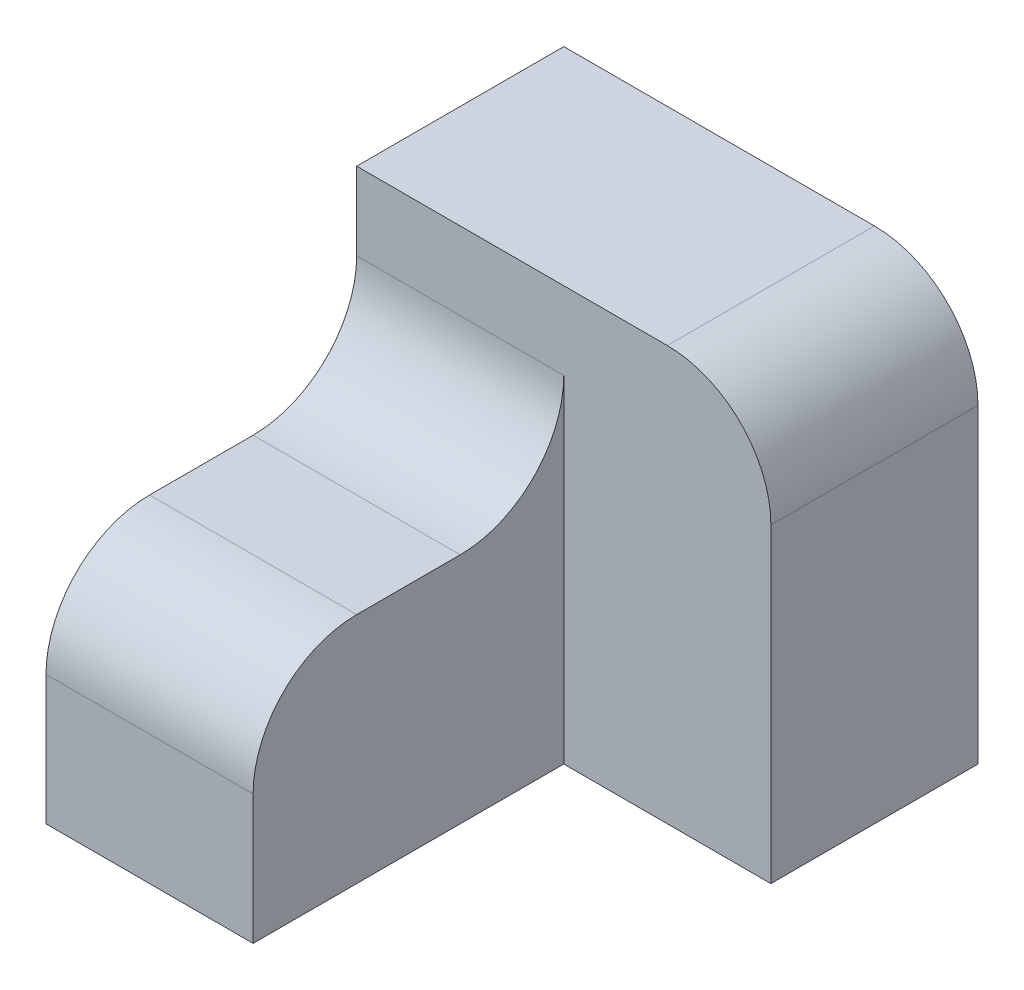
ISO-10303-21;
HEADER;
FILE_DESCRIPTION(('STEP AP214'),'2;1');
FILE_NAME('part.step','',(''),(''),'','','');
FILE_SCHEMA(('AUTOMOTIVE_DESIGN { 1 0 10303 214 1 1 1 1 }'));
ENDSEC;
DATA;
#1=APPLICATION_CONTEXT('core data for automotive mechanical design processes');
#2=APPLICATION_PROTOCOL_DEFINITION('international standard','automotive_design',2000,#1);
#3=PRODUCT_CONTEXT('',#1,'mechanical');
#4=PRODUCT('Part','Part','',(#3));
#5=PRODUCT_RELATED_PRODUCT_CATEGORY('part','',(#4));
#6=PRODUCT_DEFINITION_FORMATION('','',#4);
#7=PRODUCT_DEFINITION_CONTEXT('part definition',#1,'design');
#8=PRODUCT_DEFINITION('design','',#6,#7);
#9=PRODUCT_DEFINITION_SHAPE('','',#8);
#10=(LENGTH_UNIT() NAMED_UNIT(*) SI_UNIT(.MILLI.,.METRE.));
#11=(NAMED_UNIT(*) PLANE_ANGLE_UNIT() SI_UNIT($,.RADIAN.));
#12=(NAMED_UNIT(*) SI_UNIT($,.STERADIAN.) SOLID_ANGLE_UNIT());
#13=UNCERTAINTY_MEASURE_WITH_UNIT(LENGTH_MEASURE(1.E-05),#10,'distance_accuracy_value','');
#14=(GEOMETRIC_REPRESENTATION_CONTEXT(3) GLOBAL_UNCERTAINTY_ASSIGNED_CONTEXT((#13)) GLOBAL_UNIT_ASSIGNED_CONTEXT((#10,
#11,#12)) REPRESENTATION_CONTEXT('',''));
#15=CARTESIAN_POINT('',(0.,0.,0.));
#16=DIRECTION('',(0.,0.,1.));
#17=DIRECTION('',(1.,0.,0.));
#18=AXIS2_PLACEMENT_3D('',#15,#16,#17);
#19=CARTESIAN_POINT('',(-10.,0.,30.));
#20=DIRECTION('',(0.,-1.,0.));
#21=DIRECTION('',(1.,0.,0.));
#22=AXIS2_PLACEMENT_3D('',#19,#20,#21);
#23=PLANE('',#22);
#24=DIRECTION('',(0.,0.,-1.));
#25=VECTOR('',#24,1.);
#26=CARTESIAN_POINT('',(-10.,0.,30.));
#27=LINE('',#26,#25);
#28=CARTESIAN_POINT('',(-10.,0.,20.));
#29=VERTEX_POINT('',#28);
#30=CARTESIAN_POINT('',(-10.,0.,10.));
#31=VERTEX_POINT('',#30);
#32=EDGE_CURVE('E164',#29,#31,#27,.T.);
#33=ORIENTED_EDGE('',*,*,#32,.T.);
#34=DIRECTION('',(-1.,0.,0.));
#35=VECTOR('',#34,1.);
#36=CARTESIAN_POINT('',(-10.,0.,10.));
#37=LINE('',#36,#35);
#38=CARTESIAN_POINT('',(-30.,0.,10.));
#39=VERTEX_POINT('',#38);
#40=EDGE_CURVE('E178',#31,#39,#37,.T.);
#41=ORIENTED_EDGE('',*,*,#40,.T.);
#42=DIRECTION('',(0.,0.,-1.));
#43=VECTOR('',#42,1.);
#44=CARTESIAN_POINT('',(-30.,0.,30.));
#45=LINE('',#44,#43);
#46=CARTESIAN_POINT('',(-30.,0.,20.));
#47=VERTEX_POINT('',#46);
#48=EDGE_CURVE('E173',#47,#39,#45,.T.);
#49=ORIENTED_EDGE('',*,*,#48,.F.);
#50=DIRECTION('',(-1.,0.,0.));
#51=VECTOR('',#50,1.);
#52=CARTESIAN_POINT('',(-10.,0.,20.));
#53=LINE('',#52,#51);
#54=EDGE_CURVE('E176',#47,#29,#53,.F.);
#55=ORIENTED_EDGE('',*,*,#54,.T.);
#56=EDGE_LOOP('',(#33,#41,#49,#55));
#57=FACE_BOUND('',#56,.T.);
#58=ADVANCED_FACE('F35',(#57),#23,.F.);
#59=CARTESIAN_POINT('',(-30.,0.,30.));
#60=DIRECTION('',(1.,0.,0.));
#61=DIRECTION('',(0.,0.,-1.));
#62=AXIS2_PLACEMENT_3D('',#59,#60,#61);
#63=PLANE('',#62);
#64=DIRECTION('',(0.,-1.,0.));
#65=VECTOR('',#64,1.);
#66=CARTESIAN_POINT('',(-30.,0.,30.));
#67=LINE('',#66,#65);
#68=CARTESIAN_POINT('',(-30.,-10.,30.));
#69=VERTEX_POINT('',#68);
#70=CARTESIAN_POINT('',(-30.,-22.5,30.));
#71=VERTEX_POINT('',#70);
#72=EDGE_CURVE('E158',#69,#71,#67,.T.);
#73=ORIENTED_EDGE('',*,*,#72,.F.);
#74=CARTESIAN_POINT('',(-30.,-10.,20.));
#75=DIRECTION('',(1.,0.,0.));
#76=DIRECTION('',(0.,0.,-1.));
#77=AXIS2_PLACEMENT_3D('',#74,#75,#76);
#78=CIRCLE('',#77,10.);
#79=EDGE_CURVE('E58',#69,#47,#78,.F.);
#80=ORIENTED_EDGE('',*,*,#79,.T.);
#81=ORIENTED_EDGE('',*,*,#48,.T.);
#82=CARTESIAN_POINT('',(-30.,10.,10.));
#83=DIRECTION('',(1.,0.,0.));
#84=DIRECTION('',(0.,0.,-1.));
#85=AXIS2_PLACEMENT_3D('',#82,#83,#84);
#86=CIRCLE('',#85,10.);
#87=CARTESIAN_POINT('',(-30.,10.,0.));
#88=VERTEX_POINT('',#87);
#89=EDGE_CURVE('E43',#39,#88,#86,.T.);
#90=ORIENTED_EDGE('',*,*,#89,.T.);
#91=DIRECTION('',(0.,-1.,0.));
#92=VECTOR('',#91,1.);
#93=CARTESIAN_POINT('',(-30.,17.5,0.));
#94=LINE('',#93,#92);
#95=CARTESIAN_POINT('',(-30.,17.5,0.));
#96=VERTEX_POINT('',#95);
#97=EDGE_CURVE('E134',#96,#88,#94,.T.);
#98=ORIENTED_EDGE('',*,*,#97,.F.);
#99=DIRECTION('',(0.,0.,1.));
#100=VECTOR('',#99,1.);
#101=CARTESIAN_POINT('',(-30.,17.5,-20.));
#102=LINE('',#101,#100);
#103=CARTESIAN_POINT('',(-30.,17.5,-20.));
#104=VERTEX_POINT('',#103);
#105=EDGE_CURVE('E118',#104,#96,#102,.T.);
#106=ORIENTED_EDGE('',*,*,#105,.F.);
#107=DIRECTION('',(0.,-1.,0.));
#108=VECTOR('',#107,1.);
#109=CARTESIAN_POINT('',(-30.,17.5,-20.));
#110=LINE('',#109,#108);
#111=CARTESIAN_POINT('',(-30.,-22.5,-20.));
#112=VERTEX_POINT('',#111);
#113=EDGE_CURVE('E125',#104,#112,#110,.T.);
#114=ORIENTED_EDGE('',*,*,#113,.T.);
#115=DIRECTION('',(0.,0.,-1.));
#116=VECTOR('',#115,1.);
#117=CARTESIAN_POINT('',(-30.,-22.5,30.));
#118=LINE('',#117,#116);
#119=EDGE_CURVE('E171',#71,#112,#118,.T.);
#120=ORIENTED_EDGE('',*,*,#119,.F.);
#121=EDGE_LOOP('',(#73,#80,#81,#90,#98,#106,#114,#120));
#122=FACE_BOUND('',#121,.T.);
#123=ADVANCED_FACE('F131',(#122),#63,.F.);
#124=CARTESIAN_POINT('',(-30.,-22.5,30.));
#125=DIRECTION('',(0.,1.,0.));
#126=DIRECTION('',(0.,0.,1.));
#127=AXIS2_PLACEMENT_3D('',#124,#125,#126);
#128=PLANE('',#127);
#129=ORIENTED_EDGE('',*,*,#119,.T.);
#130=DIRECTION('',(1.,0.,0.));
#131=VECTOR('',#130,1.);
#132=CARTESIAN_POINT('',(-30.,-22.5,-20.));
#133=LINE('',#132,#131);
#134=CARTESIAN_POINT('',(10.,-22.5,-20.));
#135=VERTEX_POINT('',#134);
#136=EDGE_CURVE('E142',#112,#135,#133,.T.);
#137=ORIENTED_EDGE('',*,*,#136,.T.);
#138=DIRECTION('',(0.,0.,1.));
#139=VECTOR('',#138,1.);
#140=CARTESIAN_POINT('',(10.,-22.5,-20.));
#141=LINE('',#140,#139);
#142=CARTESIAN_POINT('',(10.,-22.5,0.));
#143=VERTEX_POINT('',#142);
#144=EDGE_CURVE('E135',#135,#143,#141,.T.);
#145=ORIENTED_EDGE('',*,*,#144,.T.);
#146=DIRECTION('',(1.,0.,0.));
#147=VECTOR('',#146,1.);
#148=CARTESIAN_POINT('',(-30.,-22.5,0.));
#149=LINE('',#148,#147);
#150=CARTESIAN_POINT('',(-10.,-22.5,0.));
#151=VERTEX_POINT('',#150);
#152=EDGE_CURVE('E151',#151,#143,#149,.T.);
#153=ORIENTED_EDGE('',*,*,#152,.F.);
#154=DIRECTION('',(0.,0.,-1.));
#155=VECTOR('',#154,1.);
#156=CARTESIAN_POINT('',(-10.,-22.5,30.));
#157=LINE('',#156,#155);
#158=CARTESIAN_POINT('',(-10.,-22.5,30.));
#159=VERTEX_POINT('',#158);
#160=EDGE_CURVE('E168',#159,#151,#157,.T.);
#161=ORIENTED_EDGE('',*,*,#160,.F.);
#162=DIRECTION('',(1.,0.,0.));
#163=VECTOR('',#162,1.);
#164=CARTESIAN_POINT('',(-30.,-22.5,30.));
#165=LINE('',#164,#163);
#166=EDGE_CURVE('E160',#71,#159,#165,.T.);
#167=ORIENTED_EDGE('',*,*,#166,.F.);
#168=EDGE_LOOP('',(#129,#137,#145,#153,#161,#167));
#169=FACE_BOUND('',#168,.T.);
#170=ADVANCED_FACE('F210',(#169),#128,.F.);
#171=CARTESIAN_POINT('',(-10.,-22.5,30.));
#172=DIRECTION('',(-1.,0.,0.));
#173=DIRECTION('',(0.,0.,1.));
#174=AXIS2_PLACEMENT_3D('',#171,#172,#173);
#175=PLANE('',#174);
#176=ORIENTED_EDGE('',*,*,#32,.F.);
#177=CARTESIAN_POINT('',(-10.,-10.,20.));
#178=DIRECTION('',(-1.,0.,0.));
#179=DIRECTION('',(0.,0.,1.));
#180=AXIS2_PLACEMENT_3D('',#177,#178,#179);
#181=CIRCLE('',#180,10.);
#182=CARTESIAN_POINT('',(-10.,-10.,30.));
#183=VERTEX_POINT('',#182);
#184=EDGE_CURVE('E50',#29,#183,#181,.F.);
#185=ORIENTED_EDGE('',*,*,#184,.T.);
#186=DIRECTION('',(0.,1.,0.));
#187=VECTOR('',#186,1.);
#188=CARTESIAN_POINT('',(-10.,-22.5,30.));
#189=LINE('',#188,#187);
#190=EDGE_CURVE('E162',#159,#183,#189,.T.);
#191=ORIENTED_EDGE('',*,*,#190,.F.);
#192=ORIENTED_EDGE('',*,*,#160,.T.);
#193=DIRECTION('',(0.,1.,0.));
#194=VECTOR('',#193,1.);
#195=CARTESIAN_POINT('',(-10.,-22.5,0.));
#196=LINE('',#195,#194);
#197=CARTESIAN_POINT('',(-10.,9.99999999999999,0.));
#198=VERTEX_POINT('',#197);
#199=EDGE_CURVE('E156',#151,#198,#196,.T.);
#200=ORIENTED_EDGE('',*,*,#199,.T.);
#201=CARTESIAN_POINT('',(-10.,10.,10.));
#202=DIRECTION('',(-1.,0.,0.));
#203=DIRECTION('',(0.,0.,1.));
#204=AXIS2_PLACEMENT_3D('',#201,#202,#203);
#205=CIRCLE('',#204,10.);
#206=EDGE_CURVE('E11',#198,#31,#205,.T.);
#207=ORIENTED_EDGE('',*,*,#206,.T.);
#208=EDGE_LOOP('',(#176,#185,#191,#192,#200,#207));
#209=FACE_BOUND('',#208,.T.);
#210=ADVANCED_FACE('F203',(#209),#175,.F.);
#211=CARTESIAN_POINT('',(0.,0.,30.));
#212=DIRECTION('',(0.,0.,1.));
#213=DIRECTION('',(1.,0.,0.));
#214=AXIS2_PLACEMENT_3D('',#211,#212,#213);
#215=PLANE('',#214);
#216=ORIENTED_EDGE('',*,*,#190,.T.);
#217=DIRECTION('',(-1.,0.,0.));
#218=VECTOR('',#217,1.);
#219=CARTESIAN_POINT('',(-30.,-10.,30.));
#220=LINE('',#219,#218);
#221=EDGE_CURVE('E192',#183,#69,#220,.T.);
#222=ORIENTED_EDGE('',*,*,#221,.T.);
#223=ORIENTED_EDGE('',*,*,#72,.T.);
#224=ORIENTED_EDGE('',*,*,#166,.T.);
#225=EDGE_LOOP('',(#216,#222,#223,#224));
#226=FACE_BOUND('',#225,.T.);
#227=ADVANCED_FACE('F206',(#226),#215,.T.);
#228=CARTESIAN_POINT('',(0.,0.,0.));
#229=DIRECTION('',(0.,0.,1.));
#230=DIRECTION('',(1.,0.,0.));
#231=AXIS2_PLACEMENT_3D('',#228,#229,#230);
#232=PLANE('',#231);
#233=ORIENTED_EDGE('',*,*,#97,.T.);
#234=DIRECTION('',(-1.,0.,0.));
#235=VECTOR('',#234,1.);
#236=CARTESIAN_POINT('',(0.,10.,0.));
#237=LINE('',#236,#235);
#238=EDGE_CURVE('E183',#88,#198,#237,.F.);
#239=ORIENTED_EDGE('',*,*,#238,.T.);
#240=ORIENTED_EDGE('',*,*,#199,.F.);
#241=ORIENTED_EDGE('',*,*,#152,.T.);
#242=DIRECTION('',(0.,1.,0.));
#243=VECTOR('',#242,1.);
#244=CARTESIAN_POINT('',(10.,-22.5,0.));
#245=LINE('',#244,#243);
#246=CARTESIAN_POINT('',(10.,7.5,0.));
#247=VERTEX_POINT('',#246);
#248=EDGE_CURVE('E126',#143,#247,#245,.T.);
#249=ORIENTED_EDGE('',*,*,#248,.T.);
#250=CARTESIAN_POINT('',(0.,7.5,0.));
#251=DIRECTION('',(0.,0.,1.));
#252=DIRECTION('',(1.,0.,0.));
#253=AXIS2_PLACEMENT_3D('',#250,#251,#252);
#254=CIRCLE('',#253,10.);
#255=CARTESIAN_POINT('',(0.,17.5,0.));
#256=VERTEX_POINT('',#255);
#257=EDGE_CURVE('E181',#247,#256,#254,.T.);
#258=ORIENTED_EDGE('',*,*,#257,.T.);
#259=DIRECTION('',(-1.,0.,0.));
#260=VECTOR('',#259,1.);
#261=CARTESIAN_POINT('',(10.,17.5,0.));
#262=LINE('',#261,#260);
#263=EDGE_CURVE('E148',#256,#96,#262,.T.);
#264=ORIENTED_EDGE('',*,*,#263,.T.);
#265=EDGE_LOOP('',(#233,#239,#240,#241,#249,#258,#264));
#266=FACE_BOUND('',#265,.T.);
#267=ADVANCED_FACE('F200',(#266),#232,.T.);
#268=CARTESIAN_POINT('',(10.,17.5,-20.));
#269=DIRECTION('',(0.,1.,0.));
#270=DIRECTION('',(-1.,0.,0.));
#271=AXIS2_PLACEMENT_3D('',#268,#269,#270);
#272=PLANE('',#271);
#273=ORIENTED_EDGE('',*,*,#263,.F.);
#274=DIRECTION('',(0.,0.,1.));
#275=VECTOR('',#274,1.);
#276=CARTESIAN_POINT('',(0.,17.5,-20.));
#277=LINE('',#276,#275);
#278=CARTESIAN_POINT('',(0.,17.5,-20.));
#279=VERTEX_POINT('',#278);
#280=EDGE_CURVE('E121',#256,#279,#277,.F.);
#281=ORIENTED_EDGE('',*,*,#280,.T.);
#282=DIRECTION('',(-1.,0.,0.));
#283=VECTOR('',#282,1.);
#284=CARTESIAN_POINT('',(10.,17.5,-20.));
#285=LINE('',#284,#283);
#286=EDGE_CURVE('E114',#279,#104,#285,.T.);
#287=ORIENTED_EDGE('',*,*,#286,.T.);
#288=ORIENTED_EDGE('',*,*,#105,.T.);
#289=EDGE_LOOP('',(#273,#281,#287,#288));
#290=FACE_BOUND('',#289,.T.);
#291=ADVANCED_FACE('F117',(#290),#272,.T.);
#292=CARTESIAN_POINT('',(10.,-22.5,-20.));
#293=DIRECTION('',(1.,0.,0.));
#294=DIRECTION('',(0.,0.,-1.));
#295=AXIS2_PLACEMENT_3D('',#292,#293,#294);
#296=PLANE('',#295);
#297=DIRECTION('',(0.,1.,0.));
#298=VECTOR('',#297,1.);
#299=CARTESIAN_POINT('',(10.,-22.5,-20.));
#300=LINE('',#299,#298);
#301=CARTESIAN_POINT('',(10.,7.5,-20.));
#302=VERTEX_POINT('',#301);
#303=EDGE_CURVE('E136',#135,#302,#300,.T.);
#304=ORIENTED_EDGE('',*,*,#303,.T.);
#305=DIRECTION('',(0.,0.,1.));
#306=VECTOR('',#305,1.);
#307=CARTESIAN_POINT('',(10.,7.5,-20.));
#308=LINE('',#307,#306);
#309=EDGE_CURVE('E186',#302,#247,#308,.T.);
#310=ORIENTED_EDGE('',*,*,#309,.T.);
#311=ORIENTED_EDGE('',*,*,#248,.F.);
#312=ORIENTED_EDGE('',*,*,#144,.F.);
#313=EDGE_LOOP('',(#304,#310,#311,#312));
#314=FACE_BOUND('',#313,.T.);
#315=ADVANCED_FACE('F214',(#314),#296,.T.);
#316=CARTESIAN_POINT('',(0.,0.,-20.));
#317=DIRECTION('',(0.,0.,1.));
#318=DIRECTION('',(1.,0.,0.));
#319=AXIS2_PLACEMENT_3D('',#316,#317,#318);
#320=PLANE('',#319);
#321=ORIENTED_EDGE('',*,*,#286,.F.);
#322=CARTESIAN_POINT('',(0.,7.5,-20.));
#323=DIRECTION('',(0.,0.,1.));
#324=DIRECTION('',(1.,0.,0.));
#325=AXIS2_PLACEMENT_3D('',#322,#323,#324);
#326=CIRCLE('',#325,10.);
#327=EDGE_CURVE('E190',#279,#302,#326,.F.);
#328=ORIENTED_EDGE('',*,*,#327,.T.);
#329=ORIENTED_EDGE('',*,*,#303,.F.);
#330=ORIENTED_EDGE('',*,*,#136,.F.);
#331=ORIENTED_EDGE('',*,*,#113,.F.);
#332=EDGE_LOOP('',(#321,#328,#329,#330,#331));
#333=FACE_BOUND('',#332,.T.);
#334=ADVANCED_FACE('F139',(#333),#320,.F.);
#335=CARTESIAN_POINT('',(-10.,10.,10.));
#336=DIRECTION('',(-1.,0.,0.));
#337=DIRECTION('',(0.,-1.,0.));
#338=AXIS2_PLACEMENT_3D('',#335,#336,#337);
#339=CYLINDRICAL_SURFACE('',#338,10.);
#340=ORIENTED_EDGE('',*,*,#206,.F.);
#341=ORIENTED_EDGE('',*,*,#238,.F.);
#342=ORIENTED_EDGE('',*,*,#89,.F.);
#343=ORIENTED_EDGE('',*,*,#40,.F.);
#344=EDGE_LOOP('',(#340,#341,#342,#343));
#345=FACE_BOUND('',#344,.T.);
#346=ADVANCED_FACE('F202',(#345),#339,.F.);
#347=CARTESIAN_POINT('',(0.,7.5,-20.));
#348=DIRECTION('',(0.,0.,1.));
#349=DIRECTION('',(1.,0.,0.));
#350=AXIS2_PLACEMENT_3D('',#347,#348,#349);
#351=CYLINDRICAL_SURFACE('',#350,10.);
#352=ORIENTED_EDGE('',*,*,#327,.F.);
#353=ORIENTED_EDGE('',*,*,#280,.F.);
#354=ORIENTED_EDGE('',*,*,#257,.F.);
#355=ORIENTED_EDGE('',*,*,#309,.F.);
#356=EDGE_LOOP('',(#352,#353,#354,#355));
#357=FACE_BOUND('',#356,.T.);
#358=ADVANCED_FACE('F217',(#357),#351,.T.);
#359=CARTESIAN_POINT('',(0.,-10.,20.));
#360=DIRECTION('',(1.,0.,0.));
#361=DIRECTION('',(0.,1.,0.));
#362=AXIS2_PLACEMENT_3D('',#359,#360,#361);
#363=CYLINDRICAL_SURFACE('',#362,10.);
#364=ORIENTED_EDGE('',*,*,#184,.F.);
#365=ORIENTED_EDGE('',*,*,#54,.F.);
#366=ORIENTED_EDGE('',*,*,#79,.F.);
#367=ORIENTED_EDGE('',*,*,#221,.F.);
#368=EDGE_LOOP('',(#364,#365,#366,#367));
#369=FACE_BOUND('',#368,.T.);
#370=ADVANCED_FACE('F37',(#369),#363,.T.);
#371=CLOSED_SHELL('',(#58,#123,#170,#210,#227,#267,#291,#315,#334,#346,#358,#370));
#372=MANIFOLD_SOLID_BREP('B2',#371);
#373=ADVANCED_BREP_SHAPE_REPRESENTATION('',(#18,#372),#14);
#374=SHAPE_DEFINITION_REPRESENTATION(#9,#373);
ENDSEC;
END-ISO-10303-21;
